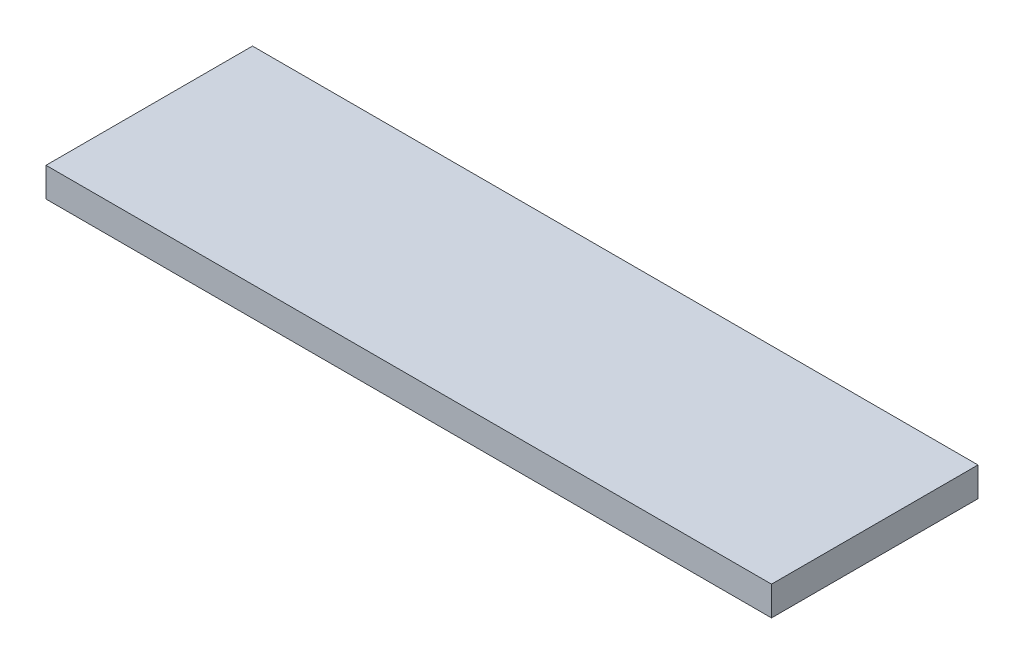
ISO-10303-21;
HEADER;
FILE_DESCRIPTION(('STEP AP214'),'2;1');
FILE_NAME('part.step','',(''),(''),'','','');
FILE_SCHEMA(('AUTOMOTIVE_DESIGN { 1 0 10303 214 1 1 1 1 }'));
ENDSEC;
DATA;
#1=APPLICATION_CONTEXT('core data for automotive mechanical design processes');
#2=APPLICATION_PROTOCOL_DEFINITION('international standard','automotive_design',2000,#1);
#3=PRODUCT_CONTEXT('',#1,'mechanical');
#4=PRODUCT('Part','Part','',(#3));
#5=PRODUCT_RELATED_PRODUCT_CATEGORY('part','',(#4));
#6=PRODUCT_DEFINITION_FORMATION('','',#4);
#7=PRODUCT_DEFINITION_CONTEXT('part definition',#1,'design');
#8=PRODUCT_DEFINITION('design','',#6,#7);
#9=PRODUCT_DEFINITION_SHAPE('','',#8);
#10=(LENGTH_UNIT() NAMED_UNIT(*) SI_UNIT(.MILLI.,.METRE.));
#11=(NAMED_UNIT(*) PLANE_ANGLE_UNIT() SI_UNIT($,.RADIAN.));
#12=(NAMED_UNIT(*) SI_UNIT($,.STERADIAN.) SOLID_ANGLE_UNIT());
#13=UNCERTAINTY_MEASURE_WITH_UNIT(LENGTH_MEASURE(1.E-05),#10,'distance_accuracy_value','');
#14=(GEOMETRIC_REPRESENTATION_CONTEXT(3) GLOBAL_UNCERTAINTY_ASSIGNED_CONTEXT((#13)) GLOBAL_UNIT_ASSIGNED_CONTEXT((#10,
#11,#12)) REPRESENTATION_CONTEXT('',''));
#15=CARTESIAN_POINT('',(0.,0.,0.));
#16=DIRECTION('',(0.,0.,1.));
#17=DIRECTION('',(1.,0.,0.));
#18=AXIS2_PLACEMENT_3D('',#15,#16,#17);
#19=CARTESIAN_POINT('',(-39.2020551048458,2.5,-23.8310365379002));
#20=DIRECTION('',(1.,0.,0.));
#21=DIRECTION('',(0.,0.,-1.));
#22=AXIS2_PLACEMENT_3D('',#19,#20,#21);
#23=PLANE('',#22);
#24=DIRECTION('',(0.,0.,1.));
#25=VECTOR('',#24,1.);
#26=CARTESIAN_POINT('',(-39.2020551048458,0.,-23.8310365379002));
#27=LINE('',#26,#25);
#28=CARTESIAN_POINT('',(-39.2020551048458,0.,-23.8310365379002));
#29=VERTEX_POINT('',#28);
#30=CARTESIAN_POINT('',(-39.2020551048458,0.,-6.19606949985405));
#31=VERTEX_POINT('',#30);
#32=EDGE_CURVE('E98',#29,#31,#27,.T.);
#33=ORIENTED_EDGE('',*,*,#32,.T.);
#34=DIRECTION('',(0.,-1.,0.));
#35=VECTOR('',#34,1.);
#36=CARTESIAN_POINT('',(-39.2020551048458,2.5,-6.19606949985405));
#37=LINE('',#36,#35);
#38=CARTESIAN_POINT('',(-39.2020551048458,2.5,-6.19606949985405));
#39=VERTEX_POINT('',#38);
#40=EDGE_CURVE('E11',#39,#31,#37,.T.);
#41=ORIENTED_EDGE('',*,*,#40,.F.);
#42=DIRECTION('',(0.,0.,1.));
#43=VECTOR('',#42,1.);
#44=CARTESIAN_POINT('',(-39.2020551048458,2.5,-23.8310365379002));
#45=LINE('',#44,#43);
#46=CARTESIAN_POINT('',(-39.2020551048458,2.5,-23.8310365379002));
#47=VERTEX_POINT('',#46);
#48=EDGE_CURVE('E86',#47,#39,#45,.T.);
#49=ORIENTED_EDGE('',*,*,#48,.F.);
#50=DIRECTION('',(0.,-1.,0.));
#51=VECTOR('',#50,1.);
#52=CARTESIAN_POINT('',(-39.2020551048458,2.5,-23.8310365379002));
#53=LINE('',#52,#51);
#54=EDGE_CURVE('E94',#47,#29,#53,.T.);
#55=ORIENTED_EDGE('',*,*,#54,.T.);
#56=EDGE_LOOP('',(#33,#41,#49,#55));
#57=FACE_BOUND('',#56,.T.);
#58=ADVANCED_FACE('F35',(#57),#23,.F.);
#59=CARTESIAN_POINT('',(-39.2020551048458,2.5,-6.19606949985405));
#60=DIRECTION('',(0.,0.,-1.));
#61=DIRECTION('',(-1.,0.,0.));
#62=AXIS2_PLACEMENT_3D('',#59,#60,#61);
#63=PLANE('',#62);
#64=DIRECTION('',(1.,0.,0.));
#65=VECTOR('',#64,1.);
#66=CARTESIAN_POINT('',(-39.2020551048458,0.,-6.19606949985405));
#67=LINE('',#66,#65);
#68=CARTESIAN_POINT('',(22.7586398936947,0.,-6.19606949985405));
#69=VERTEX_POINT('',#68);
#70=EDGE_CURVE('E90',#31,#69,#67,.T.);
#71=ORIENTED_EDGE('',*,*,#70,.T.);
#72=DIRECTION('',(0.,-1.,0.));
#73=VECTOR('',#72,1.);
#74=CARTESIAN_POINT('',(22.7586398936947,2.5,-6.19606949985405));
#75=LINE('',#74,#73);
#76=CARTESIAN_POINT('',(22.7586398936947,2.5,-6.19606949985405));
#77=VERTEX_POINT('',#76);
#78=EDGE_CURVE('E43',#77,#69,#75,.T.);
#79=ORIENTED_EDGE('',*,*,#78,.F.);
#80=DIRECTION('',(1.,0.,0.));
#81=VECTOR('',#80,1.);
#82=CARTESIAN_POINT('',(-39.2020551048458,2.5,-6.19606949985405));
#83=LINE('',#82,#81);
#84=EDGE_CURVE('E81',#39,#77,#83,.T.);
#85=ORIENTED_EDGE('',*,*,#84,.F.);
#86=ORIENTED_EDGE('',*,*,#40,.T.);
#87=EDGE_LOOP('',(#71,#79,#85,#86));
#88=FACE_BOUND('',#87,.T.);
#89=ADVANCED_FACE('F89',(#88),#63,.F.);
#90=CARTESIAN_POINT('',(22.7586398936947,2.5,-23.8310365379002));
#91=DIRECTION('',(-1.,0.,0.));
#92=DIRECTION('',(0.,0.,1.));
#93=AXIS2_PLACEMENT_3D('',#90,#91,#92);
#94=PLANE('',#93);
#95=DIRECTION('',(0.,0.,-1.));
#96=VECTOR('',#95,1.);
#97=CARTESIAN_POINT('',(22.7586398936947,0.,-23.8310365379002));
#98=LINE('',#97,#96);
#99=CARTESIAN_POINT('',(22.7586398936947,0.,-23.8310365379002));
#100=VERTEX_POINT('',#99);
#101=EDGE_CURVE('E68',#69,#100,#98,.T.);
#102=ORIENTED_EDGE('',*,*,#101,.T.);
#103=DIRECTION('',(0.,-1.,0.));
#104=VECTOR('',#103,1.);
#105=CARTESIAN_POINT('',(22.7586398936947,2.5,-23.8310365379002));
#106=LINE('',#105,#104);
#107=CARTESIAN_POINT('',(22.7586398936947,2.5,-23.8310365379002));
#108=VERTEX_POINT('',#107);
#109=EDGE_CURVE('E91',#108,#100,#106,.T.);
#110=ORIENTED_EDGE('',*,*,#109,.F.);
#111=DIRECTION('',(0.,0.,-1.));
#112=VECTOR('',#111,1.);
#113=CARTESIAN_POINT('',(22.7586398936947,2.5,-23.8310365379002));
#114=LINE('',#113,#112);
#115=EDGE_CURVE('E84',#77,#108,#114,.T.);
#116=ORIENTED_EDGE('',*,*,#115,.F.);
#117=ORIENTED_EDGE('',*,*,#78,.T.);
#118=EDGE_LOOP('',(#102,#110,#116,#117));
#119=FACE_BOUND('',#118,.T.);
#120=ADVANCED_FACE('F92',(#119),#94,.F.);
#121=CARTESIAN_POINT('',(-39.2020551048458,2.5,-23.8310365379002));
#122=DIRECTION('',(0.,0.,1.));
#123=DIRECTION('',(1.,0.,0.));
#124=AXIS2_PLACEMENT_3D('',#121,#122,#123);
#125=PLANE('',#124);
#126=DIRECTION('',(-1.,0.,0.));
#127=VECTOR('',#126,1.);
#128=CARTESIAN_POINT('',(-39.2020551048458,0.,-23.8310365379002));
#129=LINE('',#128,#127);
#130=EDGE_CURVE('E74',#100,#29,#129,.T.);
#131=ORIENTED_EDGE('',*,*,#130,.T.);
#132=ORIENTED_EDGE('',*,*,#54,.F.);
#133=DIRECTION('',(-1.,0.,0.));
#134=VECTOR('',#133,1.);
#135=CARTESIAN_POINT('',(-39.2020551048458,2.5,-23.8310365379002));
#136=LINE('',#135,#134);
#137=EDGE_CURVE('E51',#108,#47,#136,.T.);
#138=ORIENTED_EDGE('',*,*,#137,.F.);
#139=ORIENTED_EDGE('',*,*,#109,.T.);
#140=EDGE_LOOP('',(#131,#132,#138,#139));
#141=FACE_BOUND('',#140,.T.);
#142=ADVANCED_FACE('F105',(#141),#125,.F.);
#143=CARTESIAN_POINT('',(0.,2.5,0.));
#144=DIRECTION('',(0.,1.,0.));
#145=DIRECTION('',(0.,0.,1.));
#146=AXIS2_PLACEMENT_3D('',#143,#144,#145);
#147=PLANE('',#146);
#148=ORIENTED_EDGE('',*,*,#48,.T.);
#149=ORIENTED_EDGE('',*,*,#84,.T.);
#150=ORIENTED_EDGE('',*,*,#115,.T.);
#151=ORIENTED_EDGE('',*,*,#137,.T.);
#152=EDGE_LOOP('',(#148,#149,#150,#151));
#153=FACE_BOUND('',#152,.T.);
#154=ADVANCED_FACE('F82',(#153),#147,.T.);
#155=CARTESIAN_POINT('',(0.,0.,0.));
#156=DIRECTION('',(0.,1.,0.));
#157=DIRECTION('',(0.,0.,1.));
#158=AXIS2_PLACEMENT_3D('',#155,#156,#157);
#159=PLANE('',#158);
#160=ORIENTED_EDGE('',*,*,#32,.F.);
#161=ORIENTED_EDGE('',*,*,#130,.F.);
#162=ORIENTED_EDGE('',*,*,#101,.F.);
#163=ORIENTED_EDGE('',*,*,#70,.F.);
#164=EDGE_LOOP('',(#160,#161,#162,#163));
#165=FACE_BOUND('',#164,.T.);
#166=ADVANCED_FACE('F108',(#165),#159,.F.);
#167=CLOSED_SHELL('',(#58,#89,#120,#142,#154,#166));
#168=MANIFOLD_SOLID_BREP('B2',#167);
#169=ADVANCED_BREP_SHAPE_REPRESENTATION('',(#18,#168),#14);
#170=SHAPE_DEFINITION_REPRESENTATION(#9,#169);
ENDSEC;
END-ISO-10303-21;
